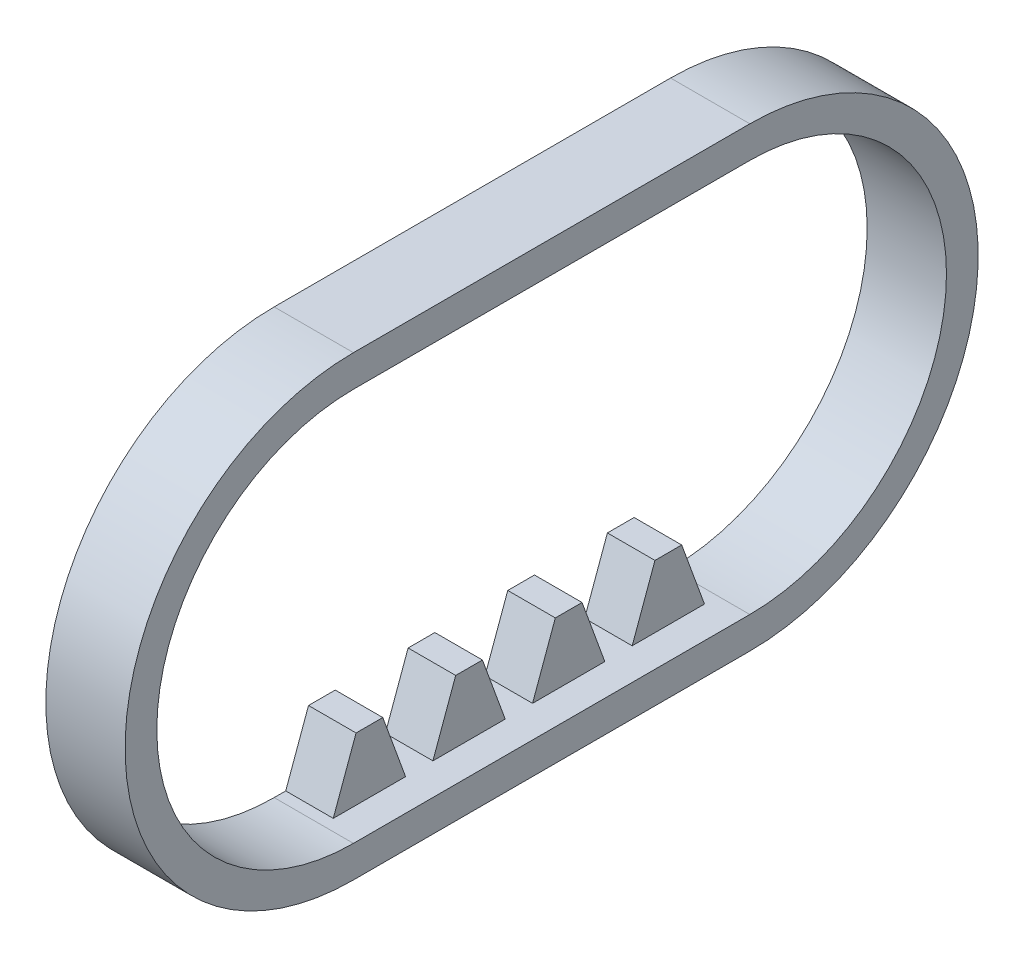
ISO-10303-21;
HEADER;
FILE_DESCRIPTION(('STEP AP214'),'2;1');
FILE_NAME('part.step','',(''),(''),'','','');
FILE_SCHEMA(('AUTOMOTIVE_DESIGN { 1 0 10303 214 1 1 1 1 }'));
ENDSEC;
DATA;
#1=APPLICATION_CONTEXT('core data for automotive mechanical design processes');
#2=APPLICATION_PROTOCOL_DEFINITION('international standard','automotive_design',2000,#1);
#3=PRODUCT_CONTEXT('',#1,'mechanical');
#4=PRODUCT('Part','Part','',(#3));
#5=PRODUCT_RELATED_PRODUCT_CATEGORY('part','',(#4));
#6=PRODUCT_DEFINITION_FORMATION('','',#4);
#7=PRODUCT_DEFINITION_CONTEXT('part definition',#1,'design');
#8=PRODUCT_DEFINITION('design','',#6,#7);
#9=PRODUCT_DEFINITION_SHAPE('','',#8);
#10=(LENGTH_UNIT() NAMED_UNIT(*) SI_UNIT(.MILLI.,.METRE.));
#11=(NAMED_UNIT(*) PLANE_ANGLE_UNIT() SI_UNIT($,.RADIAN.));
#12=(NAMED_UNIT(*) SI_UNIT($,.STERADIAN.) SOLID_ANGLE_UNIT());
#13=UNCERTAINTY_MEASURE_WITH_UNIT(LENGTH_MEASURE(1.E-05),#10,'distance_accuracy_value','');
#14=(GEOMETRIC_REPRESENTATION_CONTEXT(3) GLOBAL_UNCERTAINTY_ASSIGNED_CONTEXT((#13)) GLOBAL_UNIT_ASSIGNED_CONTEXT((#10,
#11,#12)) REPRESENTATION_CONTEXT('',''));
#15=CARTESIAN_POINT('',(0.,0.,0.));
#16=DIRECTION('',(0.,0.,1.));
#17=DIRECTION('',(1.,0.,0.));
#18=AXIS2_PLACEMENT_3D('',#15,#16,#17);
#19=CARTESIAN_POINT('',(-25.8940195497081,-9.41775513098237,27.4881064480297));
#20=DIRECTION('',(-1.,0.,0.));
#21=DIRECTION('',(0.,1.,0.));
#22=AXIS2_PLACEMENT_3D('',#19,#20,#21);
#23=PLANE('',#22);
#24=CARTESIAN_POINT('',(-25.8940195497081,-9.41775513098237,27.4881064480297));
#25=DIRECTION('',(-1.,0.,0.));
#26=DIRECTION('',(0.,1.,0.));
#27=AXIS2_PLACEMENT_3D('',#24,#25,#26);
#28=CIRCLE('',#27,14.4);
#29=CARTESIAN_POINT('',(-25.8940195497081,-23.8177551309824,27.4881064480297));
#30=VERTEX_POINT('',#29);
#31=CARTESIAN_POINT('',(-25.8940195497081,4.98224486901763,27.4881064480297));
#32=VERTEX_POINT('',#31);
#33=EDGE_CURVE('P0_E118',#30,#32,#28,.T.);
#34=ORIENTED_EDGE('',*,*,#33,.T.);
#35=DIRECTION('',(0.,0.,-1.));
#36=VECTOR('',#35,1.);
#37=CARTESIAN_POINT('',(-25.8940195497081,4.98224486901763,27.4881064480297));
#38=LINE('',#37,#36);
#39=CARTESIAN_POINT('',(-25.8940195497081,4.98224486901763,2.48810644802971));
#40=VERTEX_POINT('',#39);
#41=EDGE_CURVE('P0_E121',#32,#40,#38,.T.);
#42=ORIENTED_EDGE('',*,*,#41,.T.);
#43=CARTESIAN_POINT('',(-25.8940195497081,-9.41775513098237,2.48810644802971));
#44=DIRECTION('',(-1.,0.,0.));
#45=DIRECTION('',(0.,1.,0.));
#46=AXIS2_PLACEMENT_3D('',#43,#44,#45);
#47=CIRCLE('',#46,14.4);
#48=CARTESIAN_POINT('',(-25.8940195497081,-23.8177551309824,2.48810644802971));
#49=VERTEX_POINT('',#48);
#50=EDGE_CURVE('P0_E124',#40,#49,#47,.T.);
#51=ORIENTED_EDGE('',*,*,#50,.T.);
#52=DIRECTION('',(0.,0.,1.));
#53=VECTOR('',#52,1.);
#54=CARTESIAN_POINT('',(-25.8940195497081,-23.8177551309824,27.4881064480297));
#55=LINE('',#54,#53);
#56=EDGE_CURVE('P0_E126',#49,#30,#55,.T.);
#57=ORIENTED_EDGE('',*,*,#56,.T.);
#58=EDGE_LOOP('',(#34,#42,#51,#57));
#59=FACE_BOUND('',#58,.T.);
#60=DIRECTION('',(0.,0.,-1.));
#61=VECTOR('',#60,1.);
#62=CARTESIAN_POINT('',(-25.8940195497081,2.98224486901763,27.4881064480297));
#63=LINE('',#62,#61);
#64=CARTESIAN_POINT('',(-25.8940195497081,2.98224486901763,27.4881064480297));
#65=VERTEX_POINT('',#64);
#66=CARTESIAN_POINT('',(-25.8940195497081,2.98224486901763,2.48810644802971));
#67=VERTEX_POINT('',#66);
#68=EDGE_CURVE('P0_E90',#65,#67,#63,.T.);
#69=ORIENTED_EDGE('',*,*,#68,.F.);
#70=CARTESIAN_POINT('',(-25.8940195497081,-9.41775513098237,27.4881064480297));
#71=DIRECTION('',(-1.,0.,0.));
#72=DIRECTION('',(0.,1.,0.));
#73=AXIS2_PLACEMENT_3D('',#70,#71,#72);
#74=CIRCLE('',#73,12.4);
#75=CARTESIAN_POINT('',(-25.8940195497081,-21.8177551309824,27.4881064480297));
#76=VERTEX_POINT('',#75);
#77=EDGE_CURVE('P0_E82',#76,#65,#74,.T.);
#78=ORIENTED_EDGE('',*,*,#77,.F.);
#79=DIRECTION('',(0.,0.,1.));
#80=VECTOR('',#79,1.);
#81=CARTESIAN_POINT('',(-25.8940195497081,-21.8177551309824,27.4881064480297));
#82=LINE('',#81,#80);
#83=CARTESIAN_POINT('',(-25.8940195497081,-21.8177551309824,2.48810644802971));
#84=VERTEX_POINT('',#83);
#85=EDGE_CURVE('P0_E104',#84,#76,#82,.T.);
#86=ORIENTED_EDGE('',*,*,#85,.F.);
#87=CARTESIAN_POINT('',(-25.8940195497081,-9.41775513098237,2.48810644802971));
#88=DIRECTION('',(-1.,0.,0.));
#89=DIRECTION('',(0.,1.,0.));
#90=AXIS2_PLACEMENT_3D('',#87,#88,#89);
#91=CIRCLE('',#90,12.4);
#92=EDGE_CURVE('P0_E102',#67,#84,#91,.T.);
#93=ORIENTED_EDGE('',*,*,#92,.F.);
#94=EDGE_LOOP('',(#69,#78,#86,#93));
#95=FACE_BOUND('',#94,.T.);
#96=ADVANCED_FACE('P0_F17',(#59,#95),#23,.T.);
#97=CARTESIAN_POINT('',(-20.8940195497081,-9.41775513098237,27.4881064480297));
#98=DIRECTION('',(-1.,0.,0.));
#99=DIRECTION('',(0.,1.,0.));
#100=AXIS2_PLACEMENT_3D('',#97,#98,#99);
#101=PLANE('',#100);
#102=CARTESIAN_POINT('',(-20.8940195497081,-9.41775513098237,27.4881064480297));
#103=DIRECTION('',(-1.,0.,0.));
#104=DIRECTION('',(0.,1.,0.));
#105=AXIS2_PLACEMENT_3D('',#102,#103,#104);
#106=CIRCLE('',#105,14.4);
#107=CARTESIAN_POINT('',(-20.8940195497081,-23.8177551309824,27.4881064480297));
#108=VERTEX_POINT('',#107);
#109=CARTESIAN_POINT('',(-20.8940195497081,4.98224486901763,27.4881064480297));
#110=VERTEX_POINT('',#109);
#111=EDGE_CURVE('P0_E98',#108,#110,#106,.T.);
#112=ORIENTED_EDGE('',*,*,#111,.F.);
#113=DIRECTION('',(0.,0.,1.));
#114=VECTOR('',#113,1.);
#115=CARTESIAN_POINT('',(-20.8940195497081,-23.8177551309824,27.4881064480297));
#116=LINE('',#115,#114);
#117=CARTESIAN_POINT('',(-20.8940195497081,-23.8177551309824,2.48810644802971));
#118=VERTEX_POINT('',#117);
#119=EDGE_CURVE('P0_E122',#118,#108,#116,.T.);
#120=ORIENTED_EDGE('',*,*,#119,.F.);
#121=CARTESIAN_POINT('',(-20.8940195497081,-9.41775513098237,2.48810644802971));
#122=DIRECTION('',(-1.,0.,0.));
#123=DIRECTION('',(0.,1.,0.));
#124=AXIS2_PLACEMENT_3D('',#121,#122,#123);
#125=CIRCLE('',#124,14.4);
#126=CARTESIAN_POINT('',(-20.8940195497081,4.98224486901763,2.48810644802971));
#127=VERTEX_POINT('',#126);
#128=EDGE_CURVE('P0_E133',#127,#118,#125,.T.);
#129=ORIENTED_EDGE('',*,*,#128,.F.);
#130=DIRECTION('',(0.,0.,-1.));
#131=VECTOR('',#130,1.);
#132=CARTESIAN_POINT('',(-20.8940195497081,4.98224486901763,27.4881064480297));
#133=LINE('',#132,#131);
#134=EDGE_CURVE('P0_E131',#110,#127,#133,.T.);
#135=ORIENTED_EDGE('',*,*,#134,.F.);
#136=EDGE_LOOP('',(#112,#120,#129,#135));
#137=FACE_BOUND('',#136,.T.);
#138=CARTESIAN_POINT('',(-20.8940195497081,-9.41775513098237,27.4881064480297));
#139=DIRECTION('',(-1.,0.,0.));
#140=DIRECTION('',(0.,1.,0.));
#141=AXIS2_PLACEMENT_3D('',#138,#139,#140);
#142=CIRCLE('',#141,12.4);
#143=CARTESIAN_POINT('',(-20.8940195497081,-21.8177551309824,27.4881064480297));
#144=VERTEX_POINT('',#143);
#145=CARTESIAN_POINT('',(-20.8940195497081,2.98224486901763,27.4881064480297));
#146=VERTEX_POINT('',#145);
#147=EDGE_CURVE('P0_E40',#144,#146,#142,.T.);
#148=ORIENTED_EDGE('',*,*,#147,.T.);
#149=DIRECTION('',(0.,0.,-1.));
#150=VECTOR('',#149,1.);
#151=CARTESIAN_POINT('',(-20.8940195497081,2.98224486901763,27.4881064480297));
#152=LINE('',#151,#150);
#153=CARTESIAN_POINT('',(-20.8940195497081,2.98224486901763,2.48810644802971));
#154=VERTEX_POINT('',#153);
#155=EDGE_CURVE('P0_E97',#146,#154,#152,.T.);
#156=ORIENTED_EDGE('',*,*,#155,.T.);
#157=CARTESIAN_POINT('',(-20.8940195497081,-9.41775513098237,2.48810644802971));
#158=DIRECTION('',(-1.,0.,0.));
#159=DIRECTION('',(0.,1.,0.));
#160=AXIS2_PLACEMENT_3D('',#157,#158,#159);
#161=CIRCLE('',#160,12.4);
#162=CARTESIAN_POINT('',(-20.8940195497081,-21.8177551309824,2.48810644802971));
#163=VERTEX_POINT('',#162);
#164=EDGE_CURVE('P0_E110',#154,#163,#161,.T.);
#165=ORIENTED_EDGE('',*,*,#164,.T.);
#166=DIRECTION('',(0.,0.,1.));
#167=VECTOR('',#166,1.);
#168=CARTESIAN_POINT('',(-20.8940195497081,-21.8177551309824,27.4881064480297));
#169=LINE('',#168,#167);
#170=EDGE_CURVE('P0_E91',#163,#144,#169,.T.);
#171=ORIENTED_EDGE('',*,*,#170,.T.);
#172=EDGE_LOOP('',(#148,#156,#165,#171));
#173=FACE_BOUND('',#172,.T.);
#174=ADVANCED_FACE('P0_F151',(#137,#173),#101,.F.);
#175=CARTESIAN_POINT('',(-25.8940195497081,-9.41775513098237,27.4881064480297));
#176=DIRECTION('',(1.,0.,0.));
#177=DIRECTION('',(0.,-1.,0.));
#178=AXIS2_PLACEMENT_3D('',#175,#176,#177);
#179=CYLINDRICAL_SURFACE('',#178,14.4);
#180=ORIENTED_EDGE('',*,*,#111,.T.);
#181=DIRECTION('',(1.,0.,0.));
#182=VECTOR('',#181,1.);
#183=CARTESIAN_POINT('',(-25.8940195497081,4.98224486901763,27.4881064480297));
#184=LINE('',#183,#182);
#185=EDGE_CURVE('P0_E11',#32,#110,#184,.T.);
#186=ORIENTED_EDGE('',*,*,#185,.F.);
#187=ORIENTED_EDGE('',*,*,#33,.F.);
#188=DIRECTION('',(1.,0.,0.));
#189=VECTOR('',#188,1.);
#190=CARTESIAN_POINT('',(-25.8940195497081,-23.8177551309824,27.4881064480297));
#191=LINE('',#190,#189);
#192=EDGE_CURVE('P0_E128',#30,#108,#191,.T.);
#193=ORIENTED_EDGE('',*,*,#192,.T.);
#194=EDGE_LOOP('',(#180,#186,#187,#193));
#195=FACE_BOUND('',#194,.T.);
#196=ADVANCED_FACE('P0_F19',(#195),#179,.T.);
#197=CARTESIAN_POINT('',(-25.8940195497081,4.98224486901763,27.4881064480297));
#198=DIRECTION('',(0.,-1.,0.));
#199=DIRECTION('',(0.,0.,1.));
#200=AXIS2_PLACEMENT_3D('',#197,#198,#199);
#201=PLANE('',#200);
#202=ORIENTED_EDGE('',*,*,#134,.T.);
#203=DIRECTION('',(1.,0.,0.));
#204=VECTOR('',#203,1.);
#205=CARTESIAN_POINT('',(-25.8940195497081,4.98224486901763,2.48810644802971));
#206=LINE('',#205,#204);
#207=EDGE_CURVE('P0_E25',#40,#127,#206,.T.);
#208=ORIENTED_EDGE('',*,*,#207,.F.);
#209=ORIENTED_EDGE('',*,*,#41,.F.);
#210=ORIENTED_EDGE('',*,*,#185,.T.);
#211=EDGE_LOOP('',(#202,#208,#209,#210));
#212=FACE_BOUND('',#211,.T.);
#213=ADVANCED_FACE('P0_F161',(#212),#201,.F.);
#214=CARTESIAN_POINT('',(-25.8940195497081,-9.41775513098237,2.48810644802971));
#215=DIRECTION('',(1.,0.,0.));
#216=DIRECTION('',(0.,-1.,0.));
#217=AXIS2_PLACEMENT_3D('',#214,#215,#216);
#218=CYLINDRICAL_SURFACE('',#217,14.4);
#219=ORIENTED_EDGE('',*,*,#128,.T.);
#220=DIRECTION('',(1.,0.,0.));
#221=VECTOR('',#220,1.);
#222=CARTESIAN_POINT('',(-25.8940195497081,-23.8177551309824,2.48810644802971));
#223=LINE('',#222,#221);
#224=EDGE_CURVE('P0_E138',#49,#118,#223,.T.);
#225=ORIENTED_EDGE('',*,*,#224,.F.);
#226=ORIENTED_EDGE('',*,*,#50,.F.);
#227=ORIENTED_EDGE('',*,*,#207,.T.);
#228=EDGE_LOOP('',(#219,#225,#226,#227));
#229=FACE_BOUND('',#228,.T.);
#230=ADVANCED_FACE('P0_F145',(#229),#218,.T.);
#231=CARTESIAN_POINT('',(-25.8940195497081,-23.8177551309824,27.4881064480297));
#232=DIRECTION('',(0.,1.,0.));
#233=DIRECTION('',(0.,0.,-1.));
#234=AXIS2_PLACEMENT_3D('',#231,#232,#233);
#235=PLANE('',#234);
#236=ORIENTED_EDGE('',*,*,#119,.T.);
#237=ORIENTED_EDGE('',*,*,#192,.F.);
#238=ORIENTED_EDGE('',*,*,#56,.F.);
#239=ORIENTED_EDGE('',*,*,#224,.T.);
#240=EDGE_LOOP('',(#236,#237,#238,#239));
#241=FACE_BOUND('',#240,.T.);
#242=ADVANCED_FACE('P0_F155',(#241),#235,.F.);
#243=CARTESIAN_POINT('',(-25.8940195497081,-9.41775513098237,27.4881064480297));
#244=DIRECTION('',(1.,0.,0.));
#245=DIRECTION('',(0.,-1.,0.));
#246=AXIS2_PLACEMENT_3D('',#243,#244,#245);
#247=CYLINDRICAL_SURFACE('',#246,12.4);
#248=ORIENTED_EDGE('',*,*,#147,.F.);
#249=DIRECTION('',(1.,0.,0.));
#250=VECTOR('',#249,1.);
#251=CARTESIAN_POINT('',(-25.8940195497081,-21.8177551309824,27.4881064480297));
#252=LINE('',#251,#250);
#253=EDGE_CURVE('P0_E86',#76,#144,#252,.T.);
#254=ORIENTED_EDGE('',*,*,#253,.F.);
#255=ORIENTED_EDGE('',*,*,#77,.T.);
#256=DIRECTION('',(1.,0.,0.));
#257=VECTOR('',#256,1.);
#258=CARTESIAN_POINT('',(-25.8940195497081,2.98224486901763,27.4881064480297));
#259=LINE('',#258,#257);
#260=EDGE_CURVE('P0_E85',#65,#146,#259,.T.);
#261=ORIENTED_EDGE('',*,*,#260,.T.);
#262=EDGE_LOOP('',(#248,#254,#255,#261));
#263=FACE_BOUND('',#262,.T.);
#264=ADVANCED_FACE('P0_F84',(#263),#247,.F.);
#265=CARTESIAN_POINT('',(-25.8940195497081,2.98224486901763,27.4881064480297));
#266=DIRECTION('',(0.,-1.,0.));
#267=DIRECTION('',(0.,0.,1.));
#268=AXIS2_PLACEMENT_3D('',#265,#266,#267);
#269=PLANE('',#268);
#270=ORIENTED_EDGE('',*,*,#155,.F.);
#271=ORIENTED_EDGE('',*,*,#260,.F.);
#272=ORIENTED_EDGE('',*,*,#68,.T.);
#273=DIRECTION('',(1.,0.,0.));
#274=VECTOR('',#273,1.);
#275=CARTESIAN_POINT('',(-25.8940195497081,2.98224486901763,2.48810644802971));
#276=LINE('',#275,#274);
#277=EDGE_CURVE('P0_E99',#67,#154,#276,.T.);
#278=ORIENTED_EDGE('',*,*,#277,.T.);
#279=EDGE_LOOP('',(#270,#271,#272,#278));
#280=FACE_BOUND('',#279,.T.);
#281=ADVANCED_FACE('P0_F94',(#280),#269,.T.);
#282=CARTESIAN_POINT('',(-25.8940195497081,-9.41775513098237,2.48810644802971));
#283=DIRECTION('',(1.,0.,0.));
#284=DIRECTION('',(0.,-1.,0.));
#285=AXIS2_PLACEMENT_3D('',#282,#283,#284);
#286=CYLINDRICAL_SURFACE('',#285,12.4);
#287=ORIENTED_EDGE('',*,*,#164,.F.);
#288=ORIENTED_EDGE('',*,*,#277,.F.);
#289=ORIENTED_EDGE('',*,*,#92,.T.);
#290=DIRECTION('',(1.,0.,0.));
#291=VECTOR('',#290,1.);
#292=CARTESIAN_POINT('',(-25.8940195497081,-21.8177551309824,2.48810644802971));
#293=LINE('',#292,#291);
#294=EDGE_CURVE('P0_E32',#84,#163,#293,.T.);
#295=ORIENTED_EDGE('',*,*,#294,.T.);
#296=EDGE_LOOP('',(#287,#288,#289,#295));
#297=FACE_BOUND('',#296,.T.);
#298=ADVANCED_FACE('P0_F185',(#297),#286,.F.);
#299=CARTESIAN_POINT('',(-25.8940195497081,-21.8177551309824,27.4881064480297));
#300=DIRECTION('',(0.,1.,0.));
#301=DIRECTION('',(0.,0.,-1.));
#302=AXIS2_PLACEMENT_3D('',#299,#300,#301);
#303=PLANE('',#302);
#304=ORIENTED_EDGE('',*,*,#170,.F.);
#305=ORIENTED_EDGE('',*,*,#294,.F.);
#306=ORIENTED_EDGE('',*,*,#85,.T.);
#307=ORIENTED_EDGE('',*,*,#253,.T.);
#308=EDGE_LOOP('',(#304,#305,#306,#307));
#309=FACE_BOUND('',#308,.T.);
#310=ADVANCED_FACE('P0_F189',(#309),#303,.T.);
#311=CLOSED_SHELL('',(#96,#174,#196,#213,#230,#242,#264,#281,#298,#310));
#312=MANIFOLD_SOLID_BREP('P0_B1',#311);
#313=CARTESIAN_POINT('',(-22.8940195497081,-17.8705551309824,2.48810644802971));
#314=DIRECTION('',(0.,1.,0.));
#315=DIRECTION('',(-1.,0.,0.));
#316=AXIS2_PLACEMENT_3D('',#313,#314,#315);
#317=PLANE('',#316);
#318=DIRECTION('',(-1.,0.,0.));
#319=VECTOR('',#318,1.);
#320=CARTESIAN_POINT('',(-22.8940195497081,-17.8705551309824,19.0391282999997));
#321=LINE('',#320,#319);
#322=CARTESIAN_POINT('',(-22.8940195497081,-17.8705551309824,19.0391282999997));
#323=VERTEX_POINT('',#322);
#324=CARTESIAN_POINT('',(-25.8940195497081,-17.8705551309824,19.0391282999997));
#325=VERTEX_POINT('',#324);
#326=EDGE_CURVE('P1_E198',#323,#325,#321,.T.);
#327=ORIENTED_EDGE('',*,*,#326,.F.);
#328=DIRECTION('',(0.,0.,-1.));
#329=VECTOR('',#328,1.);
#330=CARTESIAN_POINT('',(-22.8940195497081,-17.8705551309824,2.48810644802971));
#331=LINE('',#330,#329);
#332=CARTESIAN_POINT('',(-22.8940195497081,-17.8705551309824,17.3530110960597));
#333=VERTEX_POINT('',#332);
#334=EDGE_CURVE('P1_E277',#323,#333,#331,.T.);
#335=ORIENTED_EDGE('',*,*,#334,.T.);
#336=DIRECTION('',(1.,0.,0.));
#337=VECTOR('',#336,1.);
#338=CARTESIAN_POINT('',(-22.8940195497081,-17.8705551309824,17.3530110960597));
#339=LINE('',#338,#337);
#340=CARTESIAN_POINT('',(-25.8940195497081,-17.8705551309824,17.3530110960597));
#341=VERTEX_POINT('',#340);
#342=EDGE_CURVE('P1_E218',#341,#333,#339,.T.);
#343=ORIENTED_EDGE('',*,*,#342,.F.);
#344=DIRECTION('',(0.,0.,-1.));
#345=VECTOR('',#344,1.);
#346=CARTESIAN_POINT('',(-25.8940195497081,-17.8705551309824,2.48810644802971));
#347=LINE('',#346,#345);
#348=EDGE_CURVE('P1_E287',#325,#341,#347,.T.);
#349=ORIENTED_EDGE('',*,*,#348,.F.);
#350=EDGE_LOOP('',(#327,#335,#343,#349));
#351=FACE_BOUND('',#350,.T.);
#352=ADVANCED_FACE('P1_F17',(#351),#317,.T.);
#353=DIRECTION('',(-1.,0.,0.));
#354=VECTOR('',#353,1.);
#355=CARTESIAN_POINT('',(-22.8940195497081,-17.8705551309824,12.7559429999997));
#356=LINE('',#355,#354);
#357=CARTESIAN_POINT('',(-22.8940195497081,-17.8705551309824,12.7559429999997));
#358=VERTEX_POINT('',#357);
#359=CARTESIAN_POINT('',(-25.8940195497081,-17.8705551309824,12.7559429999997));
#360=VERTEX_POINT('',#359);
#361=EDGE_CURVE('P1_E222',#358,#360,#356,.T.);
#362=ORIENTED_EDGE('',*,*,#361,.F.);
#363=CARTESIAN_POINT('',(-22.8940195497081,-17.8705551309824,11.0698257960597));
#364=VERTEX_POINT('',#363);
#365=EDGE_CURVE('P1_E327',#358,#364,#331,.T.);
#366=ORIENTED_EDGE('',*,*,#365,.T.);
#367=DIRECTION('',(1.,0.,0.));
#368=VECTOR('',#367,1.);
#369=CARTESIAN_POINT('',(-22.8940195497081,-17.8705551309824,11.0698257960597));
#370=LINE('',#369,#368);
#371=CARTESIAN_POINT('',(-25.8940195497081,-17.8705551309824,11.0698257960597));
#372=VERTEX_POINT('',#371);
#373=EDGE_CURVE('P1_E242',#372,#364,#370,.T.);
#374=ORIENTED_EDGE('',*,*,#373,.F.);
#375=EDGE_CURVE('P1_E312',#360,#372,#347,.T.);
#376=ORIENTED_EDGE('',*,*,#375,.F.);
#377=EDGE_LOOP('',(#362,#366,#374,#376));
#378=FACE_BOUND('',#377,.T.);
#379=ADVANCED_FACE('P1_F341',(#378),#317,.T.);
#380=DIRECTION('',(-1.,0.,0.));
#381=VECTOR('',#380,1.);
#382=CARTESIAN_POINT('',(-22.8940195497081,-17.8705551309824,6.47275769999967));
#383=LINE('',#382,#381);
#384=CARTESIAN_POINT('',(-22.8940195497081,-17.8705551309824,6.47275769999967));
#385=VERTEX_POINT('',#384);
#386=CARTESIAN_POINT('',(-25.8940195497081,-17.8705551309824,6.47275769999967));
#387=VERTEX_POINT('',#386);
#388=EDGE_CURVE('P1_E246',#385,#387,#383,.T.);
#389=ORIENTED_EDGE('',*,*,#388,.F.);
#390=CARTESIAN_POINT('',(-22.8940195497081,-17.8705551309824,4.78664049605974));
#391=VERTEX_POINT('',#390);
#392=EDGE_CURVE('P1_E274',#385,#391,#331,.T.);
#393=ORIENTED_EDGE('',*,*,#392,.T.);
#394=DIRECTION('',(1.,0.,0.));
#395=VECTOR('',#394,1.);
#396=CARTESIAN_POINT('',(-22.8940195497081,-17.8705551309824,4.78664049605974));
#397=LINE('',#396,#395);
#398=CARTESIAN_POINT('',(-25.8940195497081,-17.8705551309824,4.78664049605974));
#399=VERTEX_POINT('',#398);
#400=EDGE_CURVE('P1_E262',#399,#391,#397,.T.);
#401=ORIENTED_EDGE('',*,*,#400,.F.);
#402=EDGE_CURVE('P1_E285',#387,#399,#347,.T.);
#403=ORIENTED_EDGE('',*,*,#402,.F.);
#404=EDGE_LOOP('',(#389,#393,#401,#403));
#405=FACE_BOUND('',#404,.T.);
#406=ADVANCED_FACE('P1_F325',(#405),#317,.T.);
#407=CARTESIAN_POINT('',(-22.8940195497081,-21.8705551309824,2.48810644802971));
#408=DIRECTION('',(0.,0.,-1.));
#409=DIRECTION('',(-1.,0.,0.));
#410=AXIS2_PLACEMENT_3D('',#407,#408,#409);
#411=PLANE('',#410);
#412=DIRECTION('',(-1.,0.,0.));
#413=VECTOR('',#412,1.);
#414=CARTESIAN_POINT('',(-22.8940195497081,-21.8177551309824,2.48810644802971));
#415=LINE('',#414,#413);
#416=CARTESIAN_POINT('',(-22.8940195497081,-21.8177551309824,2.48810644802971));
#417=VERTEX_POINT('',#416);
#418=CARTESIAN_POINT('',(-25.8940195497081,-21.8177551309824,2.48810644802971));
#419=VERTEX_POINT('',#418);
#420=EDGE_CURVE('P1_E260',#417,#419,#415,.T.);
#421=ORIENTED_EDGE('',*,*,#420,.F.);
#422=DIRECTION('',(0.,-1.,0.));
#423=VECTOR('',#422,1.);
#424=CARTESIAN_POINT('',(-22.8940195497081,-21.8705551309824,2.48810644802971));
#425=LINE('',#424,#423);
#426=CARTESIAN_POINT('',(-22.8940195497081,-21.8705551309824,2.48810644802971));
#427=VERTEX_POINT('',#426);
#428=EDGE_CURVE('P1_E266',#417,#427,#425,.T.);
#429=ORIENTED_EDGE('',*,*,#428,.T.);
#430=DIRECTION('',(-1.,0.,0.));
#431=VECTOR('',#430,1.);
#432=CARTESIAN_POINT('',(-22.8940195497081,-21.8705551309824,2.48810644802971));
#433=LINE('',#432,#431);
#434=CARTESIAN_POINT('',(-25.8940195497081,-21.8705551309824,2.48810644802971));
#435=VERTEX_POINT('',#434);
#436=EDGE_CURVE('P1_E276',#427,#435,#433,.T.);
#437=ORIENTED_EDGE('',*,*,#436,.T.);
#438=DIRECTION('',(0.,-1.,0.));
#439=VECTOR('',#438,1.);
#440=CARTESIAN_POINT('',(-25.8940195497081,-21.8705551309824,2.48810644802971));
#441=LINE('',#440,#439);
#442=EDGE_CURVE('P1_E265',#419,#435,#441,.T.);
#443=ORIENTED_EDGE('',*,*,#442,.F.);
#444=EDGE_LOOP('',(#421,#429,#437,#443));
#445=FACE_BOUND('',#444,.T.);
#446=ADVANCED_FACE('P1_F19',(#445),#411,.T.);
#447=DIRECTION('',(-1.,0.,0.));
#448=VECTOR('',#447,1.);
#449=CARTESIAN_POINT('',(-22.8940195497081,-17.8705551309824,25.3223135999997));
#450=LINE('',#449,#448);
#451=CARTESIAN_POINT('',(-22.8940195497081,-17.8705551309824,25.3223135999997));
#452=VERTEX_POINT('',#451);
#453=CARTESIAN_POINT('',(-25.8940195497081,-17.8705551309824,25.3223135999997));
#454=VERTEX_POINT('',#453);
#455=EDGE_CURVE('P1_E177',#452,#454,#450,.T.);
#456=ORIENTED_EDGE('',*,*,#455,.F.);
#457=CARTESIAN_POINT('',(-22.8940195497081,-17.8705551309824,23.6361963960597));
#458=VERTEX_POINT('',#457);
#459=EDGE_CURVE('P1_E171',#452,#458,#331,.T.);
#460=ORIENTED_EDGE('',*,*,#459,.T.);
#461=DIRECTION('',(1.,0.,0.));
#462=VECTOR('',#461,1.);
#463=CARTESIAN_POINT('',(-22.8940195497081,-17.8705551309824,23.6361963960597));
#464=LINE('',#463,#462);
#465=CARTESIAN_POINT('',(-25.8940195497081,-17.8705551309824,23.6361963960597));
#466=VERTEX_POINT('',#465);
#467=EDGE_CURVE('P1_E194',#466,#458,#464,.T.);
#468=ORIENTED_EDGE('',*,*,#467,.F.);
#469=EDGE_CURVE('P1_E269',#454,#466,#347,.T.);
#470=ORIENTED_EDGE('',*,*,#469,.F.);
#471=EDGE_LOOP('',(#456,#460,#468,#470));
#472=FACE_BOUND('',#471,.T.);
#473=ADVANCED_FACE('P1_F365',(#472),#317,.T.);
#474=CARTESIAN_POINT('',(-22.8940195497081,-21.8705551309824,27.4881064480297));
#475=DIRECTION('',(0.,0.,1.));
#476=DIRECTION('',(1.,0.,0.));
#477=AXIS2_PLACEMENT_3D('',#474,#475,#476);
#478=PLANE('',#477);
#479=DIRECTION('',(1.,0.,0.));
#480=VECTOR('',#479,1.);
#481=CARTESIAN_POINT('',(-22.8940195497081,-21.8177551309824,27.4881064480297));
#482=LINE('',#481,#480);
#483=CARTESIAN_POINT('',(-25.8940195497081,-21.8177551309824,27.4881064480297));
#484=VERTEX_POINT('',#483);
#485=CARTESIAN_POINT('',(-22.8940195497081,-21.8177551309824,27.4881064480297));
#486=VERTEX_POINT('',#485);
#487=EDGE_CURVE('P1_E158',#484,#486,#482,.T.);
#488=ORIENTED_EDGE('',*,*,#487,.F.);
#489=DIRECTION('',(0.,1.,0.));
#490=VECTOR('',#489,1.);
#491=CARTESIAN_POINT('',(-25.8940195497081,-21.8705551309824,27.4881064480297));
#492=LINE('',#491,#490);
#493=CARTESIAN_POINT('',(-25.8940195497081,-21.8705551309824,27.4881064480297));
#494=VERTEX_POINT('',#493);
#495=EDGE_CURVE('P1_E282',#494,#484,#492,.T.);
#496=ORIENTED_EDGE('',*,*,#495,.F.);
#497=DIRECTION('',(-1.,0.,0.));
#498=VECTOR('',#497,1.);
#499=CARTESIAN_POINT('',(-22.8940195497081,-21.8705551309824,27.4881064480297));
#500=LINE('',#499,#498);
#501=CARTESIAN_POINT('',(-22.8940195497081,-21.8705551309824,27.4881064480297));
#502=VERTEX_POINT('',#501);
#503=EDGE_CURVE('P1_E288',#502,#494,#500,.T.);
#504=ORIENTED_EDGE('',*,*,#503,.F.);
#505=DIRECTION('',(0.,1.,0.));
#506=VECTOR('',#505,1.);
#507=CARTESIAN_POINT('',(-22.8940195497081,-21.8705551309824,27.4881064480297));
#508=LINE('',#507,#506);
#509=EDGE_CURVE('P1_E272',#502,#486,#508,.T.);
#510=ORIENTED_EDGE('',*,*,#509,.T.);
#511=EDGE_LOOP('',(#488,#496,#504,#510));
#512=FACE_BOUND('',#511,.T.);
#513=ADVANCED_FACE('P1_F372',(#512),#478,.T.);
#514=CARTESIAN_POINT('',(-22.8940195497081,-21.8705551309824,2.48810644802971));
#515=DIRECTION('',(0.,-1.,0.));
#516=DIRECTION('',(1.,0.,0.));
#517=AXIS2_PLACEMENT_3D('',#514,#515,#516);
#518=PLANE('',#517);
#519=DIRECTION('',(0.,0.,1.));
#520=VECTOR('',#519,1.);
#521=CARTESIAN_POINT('',(-25.8940195497081,-21.8705551309824,2.48810644802971));
#522=LINE('',#521,#520);
#523=EDGE_CURVE('P1_E279',#435,#494,#522,.T.);
#524=ORIENTED_EDGE('',*,*,#523,.F.);
#525=ORIENTED_EDGE('',*,*,#436,.F.);
#526=DIRECTION('',(0.,0.,1.));
#527=VECTOR('',#526,1.);
#528=CARTESIAN_POINT('',(-22.8940195497081,-21.8705551309824,2.48810644802971));
#529=LINE('',#528,#527);
#530=EDGE_CURVE('P1_E268',#427,#502,#529,.T.);
#531=ORIENTED_EDGE('',*,*,#530,.T.);
#532=ORIENTED_EDGE('',*,*,#503,.T.);
#533=EDGE_LOOP('',(#524,#525,#531,#532));
#534=FACE_BOUND('',#533,.T.);
#535=ADVANCED_FACE('P1_F378',(#534),#518,.T.);
#536=CARTESIAN_POINT('',(-22.8940195497081,-17.8705551309824,2.48810644802971));
#537=DIRECTION('',(1.,0.,0.));
#538=DIRECTION('',(0.,0.,-1.));
#539=AXIS2_PLACEMENT_3D('',#536,#537,#538);
#540=PLANE('',#539);
#541=DIRECTION('',(0.,-0.93969262078591,0.342020143325663));
#542=VECTOR('',#541,1.);
#543=CARTESIAN_POINT('',(-22.8940195497081,-17.2923551309824,25.111866010547));
#544=LINE('',#543,#542);
#545=CARTESIAN_POINT('',(-22.8940195497081,-21.8177551309824,26.7589769086952));
#546=VERTEX_POINT('',#545);
#547=EDGE_CURVE('P1_E155',#452,#546,#544,.T.);
#548=ORIENTED_EDGE('',*,*,#547,.T.);
#549=DIRECTION('',(0.,0.,1.));
#550=VECTOR('',#549,1.);
#551=CARTESIAN_POINT('',(-22.8940195497081,-21.8177551309824,28.4827183873642));
#552=LINE('',#551,#550);
#553=EDGE_CURVE('P1_E159',#546,#486,#552,.T.);
#554=ORIENTED_EDGE('',*,*,#553,.T.);
#555=ORIENTED_EDGE('',*,*,#509,.F.);
#556=ORIENTED_EDGE('',*,*,#530,.F.);
#557=ORIENTED_EDGE('',*,*,#428,.F.);
#558=DIRECTION('',(0.,0.,1.));
#559=VECTOR('',#558,1.);
#560=CARTESIAN_POINT('',(-22.8940195497081,-21.8177551309824,3.34997718736422));
#561=LINE('',#560,#559);
#562=CARTESIAN_POINT('',(-22.8940195497081,-21.8177551309824,3.34997718736422));
#563=VERTEX_POINT('',#562);
#564=EDGE_CURVE('P1_E249',#417,#563,#561,.T.);
#565=ORIENTED_EDGE('',*,*,#564,.T.);
#566=DIRECTION('',(0.,0.93969262078591,0.342020143325663));
#567=VECTOR('',#566,1.);
#568=CARTESIAN_POINT('',(-22.8940195497081,-17.2923551309824,4.99708808551246));
#569=LINE('',#568,#567);
#570=EDGE_CURVE('P1_E252',#563,#391,#569,.T.);
#571=ORIENTED_EDGE('',*,*,#570,.T.);
#572=ORIENTED_EDGE('',*,*,#392,.F.);
#573=DIRECTION('',(0.,-0.93969262078591,0.342020143325663));
#574=VECTOR('',#573,1.);
#575=CARTESIAN_POINT('',(-22.8940195497081,-17.2923551309824,6.26231011054696));
#576=LINE('',#575,#574);
#577=CARTESIAN_POINT('',(-22.8940195497081,-21.8177551309824,7.9094210086952));
#578=VERTEX_POINT('',#577);
#579=EDGE_CURVE('P1_E225',#385,#578,#576,.T.);
#580=ORIENTED_EDGE('',*,*,#579,.T.);
#581=DIRECTION('',(0.,0.,1.));
#582=VECTOR('',#581,1.);
#583=CARTESIAN_POINT('',(-22.8940195497081,-21.8177551309824,9.63316248736422));
#584=LINE('',#583,#582);
#585=CARTESIAN_POINT('',(-22.8940195497081,-21.8177551309824,9.63316248736422));
#586=VERTEX_POINT('',#585);
#587=EDGE_CURVE('P1_E228',#578,#586,#584,.T.);
#588=ORIENTED_EDGE('',*,*,#587,.T.);
#589=DIRECTION('',(0.,0.93969262078591,0.342020143325663));
#590=VECTOR('',#589,1.);
#591=CARTESIAN_POINT('',(-22.8940195497081,-17.2923551309824,11.2802733855125));
#592=LINE('',#591,#590);
#593=EDGE_CURVE('P1_E232',#586,#364,#592,.T.);
#594=ORIENTED_EDGE('',*,*,#593,.T.);
#595=ORIENTED_EDGE('',*,*,#365,.F.);
#596=DIRECTION('',(0.,-0.93969262078591,0.342020143325663));
#597=VECTOR('',#596,1.);
#598=CARTESIAN_POINT('',(-22.8940195497081,-17.2923551309824,12.545495410547));
#599=LINE('',#598,#597);
#600=CARTESIAN_POINT('',(-22.8940195497081,-21.8177551309824,14.1926063086952));
#601=VERTEX_POINT('',#600);
#602=EDGE_CURVE('P1_E201',#358,#601,#599,.T.);
#603=ORIENTED_EDGE('',*,*,#602,.T.);
#604=DIRECTION('',(0.,0.,1.));
#605=VECTOR('',#604,1.);
#606=CARTESIAN_POINT('',(-22.8940195497081,-21.8177551309824,15.9163477873642));
#607=LINE('',#606,#605);
#608=CARTESIAN_POINT('',(-22.8940195497081,-21.8177551309824,15.9163477873642));
#609=VERTEX_POINT('',#608);
#610=EDGE_CURVE('P1_E204',#601,#609,#607,.T.);
#611=ORIENTED_EDGE('',*,*,#610,.T.);
#612=DIRECTION('',(0.,0.93969262078591,0.342020143325663));
#613=VECTOR('',#612,1.);
#614=CARTESIAN_POINT('',(-22.8940195497081,-17.2923551309824,17.5634586855125));
#615=LINE('',#614,#613);
#616=EDGE_CURVE('P1_E208',#609,#333,#615,.T.);
#617=ORIENTED_EDGE('',*,*,#616,.T.);
#618=ORIENTED_EDGE('',*,*,#334,.F.);
#619=DIRECTION('',(0.,-0.93969262078591,0.342020143325663));
#620=VECTOR('',#619,1.);
#621=CARTESIAN_POINT('',(-22.8940195497081,-17.2923551309824,18.828680710547));
#622=LINE('',#621,#620);
#623=CARTESIAN_POINT('',(-22.8940195497081,-21.8177551309824,20.4757916086952));
#624=VERTEX_POINT('',#623);
#625=EDGE_CURVE('P1_E180',#323,#624,#622,.T.);
#626=ORIENTED_EDGE('',*,*,#625,.T.);
#627=DIRECTION('',(0.,0.,1.));
#628=VECTOR('',#627,1.);
#629=CARTESIAN_POINT('',(-22.8940195497081,-21.8177551309824,22.1995330873642));
#630=LINE('',#629,#628);
#631=CARTESIAN_POINT('',(-22.8940195497081,-21.8177551309824,22.1995330873642));
#632=VERTEX_POINT('',#631);
#633=EDGE_CURVE('P1_E183',#624,#632,#630,.T.);
#634=ORIENTED_EDGE('',*,*,#633,.T.);
#635=DIRECTION('',(0.,0.93969262078591,0.342020143325663));
#636=VECTOR('',#635,1.);
#637=CARTESIAN_POINT('',(-22.8940195497081,-17.2923551309824,23.8466439855125));
#638=LINE('',#637,#636);
#639=EDGE_CURVE('P1_E187',#632,#458,#638,.T.);
#640=ORIENTED_EDGE('',*,*,#639,.T.);
#641=ORIENTED_EDGE('',*,*,#459,.F.);
#642=EDGE_LOOP('',(#548,#554,#555,#556,#557,#565,#571,#572,#580,#588,#594,#595,#603,#611,#617,
#618,#626,#634,#640,#641));
#643=FACE_BOUND('',#642,.T.);
#644=ADVANCED_FACE('P1_F169',(#643),#540,.T.);
#645=CARTESIAN_POINT('',(-25.8940195497081,-17.8705551309824,2.48810644802971));
#646=DIRECTION('',(1.,0.,0.));
#647=DIRECTION('',(0.,0.,-1.));
#648=AXIS2_PLACEMENT_3D('',#645,#646,#647);
#649=PLANE('',#648);
#650=DIRECTION('',(0.,0.,1.));
#651=VECTOR('',#650,1.);
#652=CARTESIAN_POINT('',(-25.8940195497081,-21.8177551309824,28.4827183873642));
#653=LINE('',#652,#651);
#654=CARTESIAN_POINT('',(-25.8940195497081,-21.8177551309824,26.7589769086952));
#655=VERTEX_POINT('',#654);
#656=EDGE_CURVE('P1_E172',#655,#484,#653,.T.);
#657=ORIENTED_EDGE('',*,*,#656,.F.);
#658=DIRECTION('',(0.,0.939692620785911,-0.342020143325663));
#659=VECTOR('',#658,1.);
#660=CARTESIAN_POINT('',(-25.8940195497081,-10.5317824138315,22.6512187749119));
#661=LINE('',#660,#659);
#662=EDGE_CURVE('P1_E11',#655,#454,#661,.T.);
#663=ORIENTED_EDGE('',*,*,#662,.T.);
#664=ORIENTED_EDGE('',*,*,#469,.T.);
#665=DIRECTION('',(0.,0.93969262078591,0.342020143325663));
#666=VECTOR('',#665,1.);
#667=CARTESIAN_POINT('',(-25.8940195497081,-17.2923551309824,23.8466439855125));
#668=LINE('',#667,#666);
#669=CARTESIAN_POINT('',(-25.8940195497081,-21.8177551309824,22.1995330873642));
#670=VERTEX_POINT('',#669);
#671=EDGE_CURVE('P1_E184',#670,#466,#668,.T.);
#672=ORIENTED_EDGE('',*,*,#671,.F.);
#673=DIRECTION('',(0.,0.,1.));
#674=VECTOR('',#673,1.);
#675=CARTESIAN_POINT('',(-25.8940195497081,-21.8177551309824,22.1995330873642));
#676=LINE('',#675,#674);
#677=CARTESIAN_POINT('',(-25.8940195497081,-21.8177551309824,20.4757916086952));
#678=VERTEX_POINT('',#677);
#679=EDGE_CURVE('P1_E179',#678,#670,#676,.T.);
#680=ORIENTED_EDGE('',*,*,#679,.F.);
#681=DIRECTION('',(0.,0.939692620785911,-0.342020143325663));
#682=VECTOR('',#681,1.);
#683=CARTESIAN_POINT('',(-25.8940195497081,-12.5511592439337,17.1030265328359));
#684=LINE('',#683,#682);
#685=EDGE_CURVE('P1_E25',#678,#325,#684,.T.);
#686=ORIENTED_EDGE('',*,*,#685,.T.);
#687=ORIENTED_EDGE('',*,*,#348,.T.);
#688=DIRECTION('',(0.,0.93969262078591,0.342020143325663));
#689=VECTOR('',#688,1.);
#690=CARTESIAN_POINT('',(-25.8940195497081,-17.2923551309824,17.5634586855125));
#691=LINE('',#690,#689);
#692=CARTESIAN_POINT('',(-25.8940195497081,-21.8177551309824,15.9163477873642));
#693=VERTEX_POINT('',#692);
#694=EDGE_CURVE('P1_E205',#693,#341,#691,.T.);
#695=ORIENTED_EDGE('',*,*,#694,.F.);
#696=DIRECTION('',(0.,0.,1.));
#697=VECTOR('',#696,1.);
#698=CARTESIAN_POINT('',(-25.8940195497081,-21.8177551309824,15.9163477873642));
#699=LINE('',#698,#697);
#700=CARTESIAN_POINT('',(-25.8940195497081,-21.8177551309824,14.1926063086952));
#701=VERTEX_POINT('',#700);
#702=EDGE_CURVE('P1_E200',#701,#693,#699,.T.);
#703=ORIENTED_EDGE('',*,*,#702,.F.);
#704=DIRECTION('',(0.,0.939692620785911,-0.342020143325663));
#705=VECTOR('',#704,1.);
#706=CARTESIAN_POINT('',(-25.8940195497081,-14.570536074036,11.55483429076));
#707=LINE('',#706,#705);
#708=EDGE_CURVE('P1_E298',#701,#360,#707,.T.);
#709=ORIENTED_EDGE('',*,*,#708,.T.);
#710=ORIENTED_EDGE('',*,*,#375,.T.);
#711=DIRECTION('',(0.,0.93969262078591,0.342020143325663));
#712=VECTOR('',#711,1.);
#713=CARTESIAN_POINT('',(-25.8940195497081,-17.2923551309824,11.2802733855125));
#714=LINE('',#713,#712);
#715=CARTESIAN_POINT('',(-25.8940195497081,-21.8177551309824,9.63316248736422));
#716=VERTEX_POINT('',#715);
#717=EDGE_CURVE('P1_E229',#716,#372,#714,.T.);
#718=ORIENTED_EDGE('',*,*,#717,.F.);
#719=DIRECTION('',(0.,0.,1.));
#720=VECTOR('',#719,1.);
#721=CARTESIAN_POINT('',(-25.8940195497081,-21.8177551309824,9.63316248736422));
#722=LINE('',#721,#720);
#723=CARTESIAN_POINT('',(-25.8940195497081,-21.8177551309824,7.9094210086952));
#724=VERTEX_POINT('',#723);
#725=EDGE_CURVE('P1_E224',#724,#716,#722,.T.);
#726=ORIENTED_EDGE('',*,*,#725,.F.);
#727=DIRECTION('',(0.,0.939692620785911,-0.342020143325663));
#728=VECTOR('',#727,1.);
#729=CARTESIAN_POINT('',(-25.8940195497081,-16.5899129041383,6.00664204868404));
#730=LINE('',#729,#728);
#731=EDGE_CURVE('P1_E295',#724,#387,#730,.T.);
#732=ORIENTED_EDGE('',*,*,#731,.T.);
#733=ORIENTED_EDGE('',*,*,#402,.T.);
#734=DIRECTION('',(0.,0.93969262078591,0.342020143325663));
#735=VECTOR('',#734,1.);
#736=CARTESIAN_POINT('',(-25.8940195497081,-17.2923551309824,4.99708808551246));
#737=LINE('',#736,#735);
#738=CARTESIAN_POINT('',(-25.8940195497081,-21.8177551309824,3.34997718736422));
#739=VERTEX_POINT('',#738);
#740=EDGE_CURVE('P1_E248',#739,#399,#737,.T.);
#741=ORIENTED_EDGE('',*,*,#740,.F.);
#742=DIRECTION('',(0.,0.,-1.));
#743=VECTOR('',#742,1.);
#744=CARTESIAN_POINT('',(-25.8940195497081,-21.8177551309824,2.48810644802971));
#745=LINE('',#744,#743);
#746=EDGE_CURVE('P1_E290',#739,#419,#745,.T.);
#747=ORIENTED_EDGE('',*,*,#746,.T.);
#748=ORIENTED_EDGE('',*,*,#442,.T.);
#749=ORIENTED_EDGE('',*,*,#523,.T.);
#750=ORIENTED_EDGE('',*,*,#495,.T.);
#751=EDGE_LOOP('',(#657,#663,#664,#672,#680,#686,#687,#695,#703,#709,#710,#718,#726,#732,#733,
#741,#747,#748,#749,#750));
#752=FACE_BOUND('',#751,.T.);
#753=ADVANCED_FACE('P1_F304',(#752),#649,.F.);
#754=CARTESIAN_POINT('',(-22.8940195497081,-17.2923551309824,4.99708808551246));
#755=DIRECTION('',(0.,-0.342020143325663,0.939692620785911));
#756=DIRECTION('',(0.,0.939692620785911,0.342020143325663));
#757=AXIS2_PLACEMENT_3D('',#754,#755,#756);
#758=PLANE('',#757);
#759=ORIENTED_EDGE('',*,*,#400,.T.);
#760=ORIENTED_EDGE('',*,*,#570,.F.);
#761=DIRECTION('',(-1.,0.,0.));
#762=VECTOR('',#761,1.);
#763=CARTESIAN_POINT('',(-22.8940195497081,-21.8177551309824,3.34997718736422));
#764=LINE('',#763,#762);
#765=EDGE_CURVE('P1_E255',#563,#739,#764,.T.);
#766=ORIENTED_EDGE('',*,*,#765,.T.);
#767=ORIENTED_EDGE('',*,*,#740,.T.);
#768=EDGE_LOOP('',(#759,#760,#766,#767));
#769=FACE_BOUND('',#768,.T.);
#770=ADVANCED_FACE('P1_F323',(#769),#758,.F.);
#771=CARTESIAN_POINT('',(-22.8940195497081,-21.8177551309824,3.34997718736422));
#772=DIRECTION('',(0.,-1.,0.));
#773=DIRECTION('',(1.,0.,0.));
#774=AXIS2_PLACEMENT_3D('',#771,#772,#773);
#775=PLANE('',#774);
#776=ORIENTED_EDGE('',*,*,#420,.T.);
#777=ORIENTED_EDGE('',*,*,#746,.F.);
#778=ORIENTED_EDGE('',*,*,#765,.F.);
#779=ORIENTED_EDGE('',*,*,#564,.F.);
#780=EDGE_LOOP('',(#776,#777,#778,#779));
#781=FACE_BOUND('',#780,.T.);
#782=ADVANCED_FACE('P1_F351',(#781),#775,.F.);
#783=CARTESIAN_POINT('',(-22.8940195497081,-17.2923551309824,6.26231011054696));
#784=DIRECTION('',(0.,-0.342020143325663,-0.939692620785911));
#785=DIRECTION('',(0.,-0.939692620785911,0.342020143325663));
#786=AXIS2_PLACEMENT_3D('',#783,#784,#785);
#787=PLANE('',#786);
#788=ORIENTED_EDGE('',*,*,#388,.T.);
#789=ORIENTED_EDGE('',*,*,#731,.F.);
#790=DIRECTION('',(-1.,0.,0.));
#791=VECTOR('',#790,1.);
#792=CARTESIAN_POINT('',(-22.8940195497081,-21.8177551309824,7.9094210086952));
#793=LINE('',#792,#791);
#794=EDGE_CURVE('P1_E235',#578,#724,#793,.T.);
#795=ORIENTED_EDGE('',*,*,#794,.F.);
#796=ORIENTED_EDGE('',*,*,#579,.F.);
#797=EDGE_LOOP('',(#788,#789,#795,#796));
#798=FACE_BOUND('',#797,.T.);
#799=ADVANCED_FACE('P1_F349',(#798),#787,.F.);
#800=CARTESIAN_POINT('',(-22.8940195497081,-17.2923551309824,11.2802733855125));
#801=DIRECTION('',(0.,-0.342020143325663,0.939692620785911));
#802=DIRECTION('',(0.,0.939692620785911,0.342020143325663));
#803=AXIS2_PLACEMENT_3D('',#800,#801,#802);
#804=PLANE('',#803);
#805=ORIENTED_EDGE('',*,*,#373,.T.);
#806=ORIENTED_EDGE('',*,*,#593,.F.);
#807=DIRECTION('',(-1.,0.,0.));
#808=VECTOR('',#807,1.);
#809=CARTESIAN_POINT('',(-22.8940195497081,-21.8177551309824,9.63316248736422));
#810=LINE('',#809,#808);
#811=EDGE_CURVE('P1_E240',#586,#716,#810,.T.);
#812=ORIENTED_EDGE('',*,*,#811,.T.);
#813=ORIENTED_EDGE('',*,*,#717,.T.);
#814=EDGE_LOOP('',(#805,#806,#812,#813));
#815=FACE_BOUND('',#814,.T.);
#816=ADVANCED_FACE('P1_F344',(#815),#804,.F.);
#817=CARTESIAN_POINT('',(-22.8940195497081,-21.8177551309824,9.63316248736422));
#818=DIRECTION('',(0.,-1.,0.));
#819=DIRECTION('',(1.,0.,0.));
#820=AXIS2_PLACEMENT_3D('',#817,#818,#819);
#821=PLANE('',#820);
#822=ORIENTED_EDGE('',*,*,#725,.T.);
#823=ORIENTED_EDGE('',*,*,#811,.F.);
#824=ORIENTED_EDGE('',*,*,#587,.F.);
#825=ORIENTED_EDGE('',*,*,#794,.T.);
#826=EDGE_LOOP('',(#822,#823,#824,#825));
#827=FACE_BOUND('',#826,.T.);
#828=ADVANCED_FACE('P1_F347',(#827),#821,.F.);
#829=CARTESIAN_POINT('',(-22.8940195497081,-17.2923551309824,12.545495410547));
#830=DIRECTION('',(0.,-0.342020143325663,-0.939692620785911));
#831=DIRECTION('',(0.,-0.939692620785911,0.342020143325663));
#832=AXIS2_PLACEMENT_3D('',#829,#830,#831);
#833=PLANE('',#832);
#834=ORIENTED_EDGE('',*,*,#361,.T.);
#835=ORIENTED_EDGE('',*,*,#708,.F.);
#836=DIRECTION('',(-1.,0.,0.));
#837=VECTOR('',#836,1.);
#838=CARTESIAN_POINT('',(-22.8940195497081,-21.8177551309824,14.1926063086952));
#839=LINE('',#838,#837);
#840=EDGE_CURVE('P1_E211',#601,#701,#839,.T.);
#841=ORIENTED_EDGE('',*,*,#840,.F.);
#842=ORIENTED_EDGE('',*,*,#602,.F.);
#843=EDGE_LOOP('',(#834,#835,#841,#842));
#844=FACE_BOUND('',#843,.T.);
#845=ADVANCED_FACE('P1_F460',(#844),#833,.F.);
#846=CARTESIAN_POINT('',(-22.8940195497081,-17.2923551309824,17.5634586855125));
#847=DIRECTION('',(0.,-0.342020143325663,0.939692620785911));
#848=DIRECTION('',(0.,0.939692620785911,0.342020143325663));
#849=AXIS2_PLACEMENT_3D('',#846,#847,#848);
#850=PLANE('',#849);
#851=ORIENTED_EDGE('',*,*,#342,.T.);
#852=ORIENTED_EDGE('',*,*,#616,.F.);
#853=DIRECTION('',(-1.,0.,0.));
#854=VECTOR('',#853,1.);
#855=CARTESIAN_POINT('',(-22.8940195497081,-21.8177551309824,15.9163477873642));
#856=LINE('',#855,#854);
#857=EDGE_CURVE('P1_E216',#609,#693,#856,.T.);
#858=ORIENTED_EDGE('',*,*,#857,.T.);
#859=ORIENTED_EDGE('',*,*,#694,.T.);
#860=EDGE_LOOP('',(#851,#852,#858,#859));
#861=FACE_BOUND('',#860,.T.);
#862=ADVANCED_FACE('P1_F334',(#861),#850,.F.);
#863=CARTESIAN_POINT('',(-22.8940195497081,-21.8177551309824,15.9163477873642));
#864=DIRECTION('',(0.,-1.,0.));
#865=DIRECTION('',(1.,0.,0.));
#866=AXIS2_PLACEMENT_3D('',#863,#864,#865);
#867=PLANE('',#866);
#868=ORIENTED_EDGE('',*,*,#702,.T.);
#869=ORIENTED_EDGE('',*,*,#857,.F.);
#870=ORIENTED_EDGE('',*,*,#610,.F.);
#871=ORIENTED_EDGE('',*,*,#840,.T.);
#872=EDGE_LOOP('',(#868,#869,#870,#871));
#873=FACE_BOUND('',#872,.T.);
#874=ADVANCED_FACE('P1_F337',(#873),#867,.F.);
#875=CARTESIAN_POINT('',(-22.8940195497081,-17.2923551309824,18.828680710547));
#876=DIRECTION('',(0.,-0.342020143325663,-0.939692620785911));
#877=DIRECTION('',(0.,-0.939692620785911,0.342020143325663));
#878=AXIS2_PLACEMENT_3D('',#875,#876,#877);
#879=PLANE('',#878);
#880=ORIENTED_EDGE('',*,*,#326,.T.);
#881=ORIENTED_EDGE('',*,*,#685,.F.);
#882=DIRECTION('',(-1.,0.,0.));
#883=VECTOR('',#882,1.);
#884=CARTESIAN_POINT('',(-22.8940195497081,-21.8177551309824,20.4757916086952));
#885=LINE('',#884,#883);
#886=EDGE_CURVE('P1_E40',#624,#678,#885,.T.);
#887=ORIENTED_EDGE('',*,*,#886,.F.);
#888=ORIENTED_EDGE('',*,*,#625,.F.);
#889=EDGE_LOOP('',(#880,#881,#887,#888));
#890=FACE_BOUND('',#889,.T.);
#891=ADVANCED_FACE('P1_F484',(#890),#879,.F.);
#892=CARTESIAN_POINT('',(-22.8940195497081,-17.2923551309824,23.8466439855125));
#893=DIRECTION('',(0.,-0.342020143325663,0.939692620785911));
#894=DIRECTION('',(0.,0.939692620785911,0.342020143325663));
#895=AXIS2_PLACEMENT_3D('',#892,#893,#894);
#896=PLANE('',#895);
#897=ORIENTED_EDGE('',*,*,#467,.T.);
#898=ORIENTED_EDGE('',*,*,#639,.F.);
#899=DIRECTION('',(-1.,0.,0.));
#900=VECTOR('',#899,1.);
#901=CARTESIAN_POINT('',(-22.8940195497081,-21.8177551309824,22.1995330873642));
#902=LINE('',#901,#900);
#903=EDGE_CURVE('P1_E192',#632,#670,#902,.T.);
#904=ORIENTED_EDGE('',*,*,#903,.T.);
#905=ORIENTED_EDGE('',*,*,#671,.T.);
#906=EDGE_LOOP('',(#897,#898,#904,#905));
#907=FACE_BOUND('',#906,.T.);
#908=ADVANCED_FACE('P1_F493',(#907),#896,.F.);
#909=CARTESIAN_POINT('',(-22.8940195497081,-21.8177551309824,22.1995330873642));
#910=DIRECTION('',(0.,-1.,0.));
#911=DIRECTION('',(1.,0.,0.));
#912=AXIS2_PLACEMENT_3D('',#909,#910,#911);
#913=PLANE('',#912);
#914=ORIENTED_EDGE('',*,*,#679,.T.);
#915=ORIENTED_EDGE('',*,*,#903,.F.);
#916=ORIENTED_EDGE('',*,*,#633,.F.);
#917=ORIENTED_EDGE('',*,*,#886,.T.);
#918=EDGE_LOOP('',(#914,#915,#916,#917));
#919=FACE_BOUND('',#918,.T.);
#920=ADVANCED_FACE('P1_F502',(#919),#913,.F.);
#921=CARTESIAN_POINT('',(-22.8940195497081,-17.2923551309824,25.111866010547));
#922=DIRECTION('',(0.,-0.342020143325663,-0.939692620785911));
#923=DIRECTION('',(0.,-0.939692620785911,0.342020143325663));
#924=AXIS2_PLACEMENT_3D('',#921,#922,#923);
#925=PLANE('',#924);
#926=ORIENTED_EDGE('',*,*,#455,.T.);
#927=ORIENTED_EDGE('',*,*,#662,.F.);
#928=DIRECTION('',(-1.,0.,0.));
#929=VECTOR('',#928,1.);
#930=CARTESIAN_POINT('',(-22.8940195497081,-21.8177551309824,26.7589769086952));
#931=LINE('',#930,#929);
#932=EDGE_CURVE('P1_E32',#546,#655,#931,.T.);
#933=ORIENTED_EDGE('',*,*,#932,.F.);
#934=ORIENTED_EDGE('',*,*,#547,.F.);
#935=EDGE_LOOP('',(#926,#927,#933,#934));
#936=FACE_BOUND('',#935,.T.);
#937=ADVANCED_FACE('P1_F153',(#936),#925,.F.);
#938=CARTESIAN_POINT('',(-22.8940195497081,-21.8177551309824,28.4827183873642));
#939=DIRECTION('',(0.,-1.,0.));
#940=DIRECTION('',(1.,0.,0.));
#941=AXIS2_PLACEMENT_3D('',#938,#939,#940);
#942=PLANE('',#941);
#943=ORIENTED_EDGE('',*,*,#487,.T.);
#944=ORIENTED_EDGE('',*,*,#553,.F.);
#945=ORIENTED_EDGE('',*,*,#932,.T.);
#946=ORIENTED_EDGE('',*,*,#656,.T.);
#947=EDGE_LOOP('',(#943,#944,#945,#946));
#948=FACE_BOUND('',#947,.T.);
#949=ADVANCED_FACE('P1_F162',(#948),#942,.F.);
#950=CLOSED_SHELL('',(#352,#379,#406,#446,#473,#513,#535,#644,#753,#770,#782,#799,#816,#828,
#845,#862,#874,#891,#908,#920,#937,#949));
#951=MANIFOLD_SOLID_BREP('P1_B1',#950);
#952=ADVANCED_BREP_SHAPE_REPRESENTATION('',(#18,#312,#951),#14);
#953=SHAPE_DEFINITION_REPRESENTATION(#9,#952);
ENDSEC;
END-ISO-10303-21;
